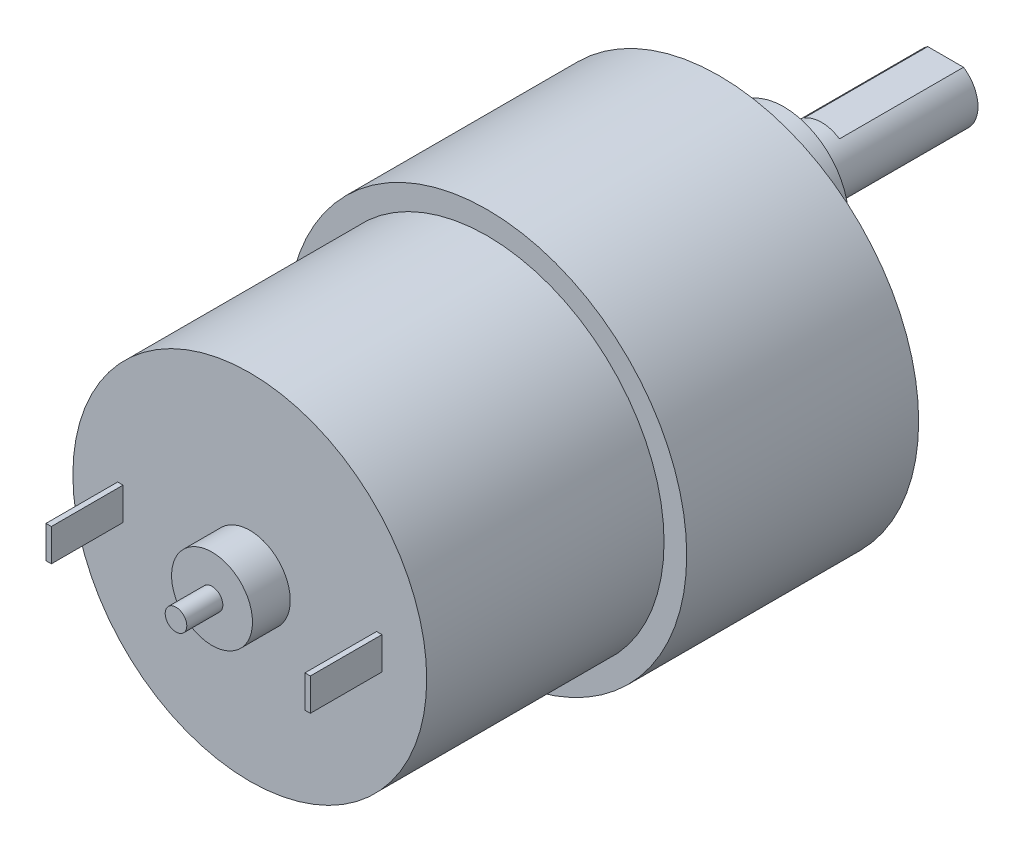
ISO-10303-21;
HEADER;
FILE_DESCRIPTION(('STEP AP214'),'2;1');
FILE_NAME('part.step','',(''),(''),'','','');
FILE_SCHEMA(('AUTOMOTIVE_DESIGN { 1 0 10303 214 1 1 1 1 }'));
ENDSEC;
DATA;
#1=APPLICATION_CONTEXT('core data for automotive mechanical design processes');
#2=APPLICATION_PROTOCOL_DEFINITION('international standard','automotive_design',2000,#1);
#3=PRODUCT_CONTEXT('',#1,'mechanical');
#4=PRODUCT('Part','Part','',(#3));
#5=PRODUCT_RELATED_PRODUCT_CATEGORY('part','',(#4));
#6=PRODUCT_DEFINITION_FORMATION('','',#4);
#7=PRODUCT_DEFINITION_CONTEXT('part definition',#1,'design');
#8=PRODUCT_DEFINITION('design','',#6,#7);
#9=PRODUCT_DEFINITION_SHAPE('','',#8);
#10=(LENGTH_UNIT() NAMED_UNIT(*) SI_UNIT(.MILLI.,.METRE.));
#11=(NAMED_UNIT(*) PLANE_ANGLE_UNIT() SI_UNIT($,.RADIAN.));
#12=(NAMED_UNIT(*) SI_UNIT($,.STERADIAN.) SOLID_ANGLE_UNIT());
#13=UNCERTAINTY_MEASURE_WITH_UNIT(LENGTH_MEASURE(1.E-05),#10,'distance_accuracy_value','');
#14=(GEOMETRIC_REPRESENTATION_CONTEXT(3) GLOBAL_UNCERTAINTY_ASSIGNED_CONTEXT((#13)) GLOBAL_UNIT_ASSIGNED_CONTEXT((#10,
#11,#12)) REPRESENTATION_CONTEXT('',''));
#15=CARTESIAN_POINT('',(0.,0.,0.));
#16=DIRECTION('',(0.,0.,1.));
#17=DIRECTION('',(1.,0.,0.));
#18=AXIS2_PLACEMENT_3D('',#15,#16,#17);
#19=CARTESIAN_POINT('',(0.,0.,43.5));
#20=DIRECTION('',(0.,0.,1.));
#21=DIRECTION('',(1.,0.,0.));
#22=AXIS2_PLACEMENT_3D('',#19,#20,#21);
#23=PLANE('',#22);
#24=CARTESIAN_POINT('',(0.,0.,43.5));
#25=DIRECTION('',(0.,0.,1.));
#26=DIRECTION('',(1.,0.,0.));
#27=AXIS2_PLACEMENT_3D('',#24,#25,#26);
#28=CIRCLE('',#27,3.75);
#29=CARTESIAN_POINT('',(3.75,0.,43.5));
#30=VERTEX_POINT('',#29);
#31=EDGE_CURVE('E171',#30,#30,#28,.T.);
#32=ORIENTED_EDGE('',*,*,#31,.F.);
#33=EDGE_LOOP('',(#32));
#34=FACE_BOUND('',#33,.T.);
#35=CARTESIAN_POINT('',(0.,0.,43.5));
#36=DIRECTION('',(0.,0.,1.));
#37=DIRECTION('',(1.,0.,0.));
#38=AXIS2_PLACEMENT_3D('',#35,#36,#37);
#39=CIRCLE('',#38,16.4);
#40=CARTESIAN_POINT('',(16.4,0.,43.5));
#41=VERTEX_POINT('',#40);
#42=EDGE_CURVE('E180',#41,#41,#39,.T.);
#43=ORIENTED_EDGE('',*,*,#42,.T.);
#44=EDGE_LOOP('',(#43));
#45=FACE_BOUND('',#44,.T.);
#46=DIRECTION('',(-1.,0.,0.));
#47=VECTOR('',#46,1.);
#48=CARTESIAN_POINT('',(-12.25,1.5,43.5));
#49=LINE('',#48,#47);
#50=CARTESIAN_POINT('',(-11.75,1.5,43.5));
#51=VERTEX_POINT('',#50);
#52=CARTESIAN_POINT('',(-12.25,1.5,43.5));
#53=VERTEX_POINT('',#52);
#54=EDGE_CURVE('E143',#51,#53,#49,.T.);
#55=ORIENTED_EDGE('',*,*,#54,.F.);
#56=DIRECTION('',(0.,1.,0.));
#57=VECTOR('',#56,1.);
#58=CARTESIAN_POINT('',(-11.75,1.5,43.5));
#59=LINE('',#58,#57);
#60=CARTESIAN_POINT('',(-11.75,-1.5,43.5));
#61=VERTEX_POINT('',#60);
#62=EDGE_CURVE('E140',#61,#51,#59,.T.);
#63=ORIENTED_EDGE('',*,*,#62,.F.);
#64=DIRECTION('',(1.,0.,0.));
#65=VECTOR('',#64,1.);
#66=CARTESIAN_POINT('',(-12.25,-1.5,43.5));
#67=LINE('',#66,#65);
#68=CARTESIAN_POINT('',(-12.25,-1.5,43.5));
#69=VERTEX_POINT('',#68);
#70=EDGE_CURVE('E152',#69,#61,#67,.T.);
#71=ORIENTED_EDGE('',*,*,#70,.F.);
#72=DIRECTION('',(0.,-1.,0.));
#73=VECTOR('',#72,1.);
#74=CARTESIAN_POINT('',(-12.25,1.5,43.5));
#75=LINE('',#74,#73);
#76=EDGE_CURVE('E160',#53,#69,#75,.T.);
#77=ORIENTED_EDGE('',*,*,#76,.F.);
#78=EDGE_LOOP('',(#55,#63,#71,#77));
#79=FACE_BOUND('',#78,.T.);
#80=DIRECTION('',(-1.,0.,0.));
#81=VECTOR('',#80,1.);
#82=CARTESIAN_POINT('',(12.25,1.5,43.5));
#83=LINE('',#82,#81);
#84=CARTESIAN_POINT('',(12.25,1.5,43.5));
#85=VERTEX_POINT('',#84);
#86=CARTESIAN_POINT('',(11.75,1.5,43.5));
#87=VERTEX_POINT('',#86);
#88=EDGE_CURVE('E625',#85,#87,#83,.T.);
#89=ORIENTED_EDGE('',*,*,#88,.F.);
#90=DIRECTION('',(0.,1.,0.));
#91=VECTOR('',#90,1.);
#92=CARTESIAN_POINT('',(12.25,1.5,43.5));
#93=LINE('',#92,#91);
#94=CARTESIAN_POINT('',(12.25,-1.5,43.5));
#95=VERTEX_POINT('',#94);
#96=EDGE_CURVE('E138',#95,#85,#93,.T.);
#97=ORIENTED_EDGE('',*,*,#96,.F.);
#98=DIRECTION('',(1.,0.,0.));
#99=VECTOR('',#98,1.);
#100=CARTESIAN_POINT('',(12.25,-1.5,43.5));
#101=LINE('',#100,#99);
#102=CARTESIAN_POINT('',(11.75,-1.5,43.5));
#103=VERTEX_POINT('',#102);
#104=EDGE_CURVE('E134',#103,#95,#101,.T.);
#105=ORIENTED_EDGE('',*,*,#104,.F.);
#106=DIRECTION('',(0.,-1.,0.));
#107=VECTOR('',#106,1.);
#108=CARTESIAN_POINT('',(11.75,1.5,43.5));
#109=LINE('',#108,#107);
#110=EDGE_CURVE('E622',#87,#103,#109,.T.);
#111=ORIENTED_EDGE('',*,*,#110,.F.);
#112=EDGE_LOOP('',(#89,#97,#105,#111));
#113=FACE_BOUND('',#112,.T.);
#114=ADVANCED_FACE('F35',(#34,#45,#79,#113),#23,.T.);
#115=CARTESIAN_POINT('',(0.,0.,21.5));
#116=DIRECTION('',(0.,0.,-1.));
#117=DIRECTION('',(-1.,0.,0.));
#118=AXIS2_PLACEMENT_3D('',#115,#116,#117);
#119=CYLINDRICAL_SURFACE('',#118,18.5);
#120=CARTESIAN_POINT('',(0.,0.,21.5));
#121=DIRECTION('',(0.,0.,1.));
#122=DIRECTION('',(1.,0.,0.));
#123=AXIS2_PLACEMENT_3D('',#120,#121,#122);
#124=CIRCLE('',#123,18.5);
#125=CARTESIAN_POINT('',(18.5,0.,21.5));
#126=VERTEX_POINT('',#125);
#127=EDGE_CURVE('E243',#126,#126,#124,.T.);
#128=ORIENTED_EDGE('',*,*,#127,.F.);
#129=EDGE_LOOP('',(#128));
#130=FACE_BOUND('',#129,.T.);
#131=CARTESIAN_POINT('',(0.,0.,0.));
#132=DIRECTION('',(0.,0.,1.));
#133=DIRECTION('',(1.,0.,0.));
#134=AXIS2_PLACEMENT_3D('',#131,#132,#133);
#135=CIRCLE('',#134,18.5);
#136=CARTESIAN_POINT('',(18.5,0.,0.));
#137=VERTEX_POINT('',#136);
#138=EDGE_CURVE('E242',#137,#137,#135,.T.);
#139=ORIENTED_EDGE('',*,*,#138,.T.);
#140=EDGE_LOOP('',(#139));
#141=FACE_BOUND('',#140,.T.);
#142=ADVANCED_FACE('F37',(#130,#141),#119,.T.);
#143=CARTESIAN_POINT('',(0.,0.,21.5));
#144=DIRECTION('',(0.,0.,1.));
#145=DIRECTION('',(1.,0.,0.));
#146=AXIS2_PLACEMENT_3D('',#143,#144,#145);
#147=PLANE('',#146);
#148=CARTESIAN_POINT('',(0.,0.,21.5));
#149=DIRECTION('',(0.,0.,1.));
#150=DIRECTION('',(1.,0.,0.));
#151=AXIS2_PLACEMENT_3D('',#148,#149,#150);
#152=CIRCLE('',#151,16.4);
#153=CARTESIAN_POINT('',(16.4,0.,21.5));
#154=VERTEX_POINT('',#153);
#155=EDGE_CURVE('E11',#154,#154,#152,.T.);
#156=ORIENTED_EDGE('',*,*,#155,.F.);
#157=EDGE_LOOP('',(#156));
#158=FACE_BOUND('',#157,.T.);
#159=ORIENTED_EDGE('',*,*,#127,.T.);
#160=EDGE_LOOP('',(#159));
#161=FACE_BOUND('',#160,.T.);
#162=ADVANCED_FACE('F255',(#158,#161),#147,.T.);
#163=CARTESIAN_POINT('',(0.,0.,0.));
#164=DIRECTION('',(0.,0.,1.));
#165=DIRECTION('',(1.,0.,0.));
#166=AXIS2_PLACEMENT_3D('',#163,#164,#165);
#167=PLANE('',#166);
#168=CARTESIAN_POINT('',(-15.5,0.,0.));
#169=DIRECTION('',(0.,0.,-1.));
#170=DIRECTION('',(-1.,0.,0.));
#171=AXIS2_PLACEMENT_3D('',#168,#169,#170);
#172=CIRCLE('',#171,1.5);
#173=CARTESIAN_POINT('',(-17.,0.,0.));
#174=VERTEX_POINT('',#173);
#175=EDGE_CURVE('E188',#174,#174,#172,.T.);
#176=ORIENTED_EDGE('',*,*,#175,.F.);
#177=EDGE_LOOP('',(#176));
#178=FACE_BOUND('',#177,.T.);
#179=CARTESIAN_POINT('',(-7.75000000000016,13.4233937586587,0.));
#180=DIRECTION('',(0.,0.,-1.));
#181=DIRECTION('',(-1.,0.,0.));
#182=AXIS2_PLACEMENT_3D('',#179,#180,#181);
#183=CIRCLE('',#182,1.5);
#184=CARTESIAN_POINT('',(-9.25000000000016,13.4233937586587,0.));
#185=VERTEX_POINT('',#184);
#186=EDGE_CURVE('E182',#185,#185,#183,.T.);
#187=ORIENTED_EDGE('',*,*,#186,.F.);
#188=EDGE_LOOP('',(#187));
#189=FACE_BOUND('',#188,.T.);
#190=CARTESIAN_POINT('',(7.74999999999987,13.4233937586589,0.));
#191=DIRECTION('',(0.,0.,-1.));
#192=DIRECTION('',(-1.,0.,0.));
#193=AXIS2_PLACEMENT_3D('',#190,#191,#192);
#194=CIRCLE('',#193,1.5);
#195=CARTESIAN_POINT('',(6.24999999999987,13.4233937586589,0.));
#196=VERTEX_POINT('',#195);
#197=EDGE_CURVE('E195',#196,#196,#194,.T.);
#198=ORIENTED_EDGE('',*,*,#197,.F.);
#199=EDGE_LOOP('',(#198));
#200=FACE_BOUND('',#199,.T.);
#201=CARTESIAN_POINT('',(15.5,1.08235921504137E-13,0.));
#202=DIRECTION('',(0.,0.,-1.));
#203=DIRECTION('',(-1.,0.,0.));
#204=AXIS2_PLACEMENT_3D('',#201,#202,#203);
#205=CIRCLE('',#204,1.5);
#206=CARTESIAN_POINT('',(14.,1.08235921504137E-13,0.));
#207=VERTEX_POINT('',#206);
#208=EDGE_CURVE('E212',#207,#207,#205,.T.);
#209=ORIENTED_EDGE('',*,*,#208,.F.);
#210=EDGE_LOOP('',(#209));
#211=FACE_BOUND('',#210,.T.);
#212=CARTESIAN_POINT('',(7.75000000000006,-13.4233937586588,0.));
#213=DIRECTION('',(0.,0.,-1.));
#214=DIRECTION('',(-1.,0.,0.));
#215=AXIS2_PLACEMENT_3D('',#212,#213,#214);
#216=CIRCLE('',#215,1.5);
#217=CARTESIAN_POINT('',(6.25000000000006,-13.4233937586588,0.));
#218=VERTEX_POINT('',#217);
#219=EDGE_CURVE('E206',#218,#218,#216,.T.);
#220=ORIENTED_EDGE('',*,*,#219,.F.);
#221=EDGE_LOOP('',(#220));
#222=FACE_BOUND('',#221,.T.);
#223=CARTESIAN_POINT('',(-7.74999999999997,-13.4233937586588,0.));
#224=DIRECTION('',(0.,0.,-1.));
#225=DIRECTION('',(-1.,0.,0.));
#226=AXIS2_PLACEMENT_3D('',#223,#224,#225);
#227=CIRCLE('',#226,1.5);
#228=CARTESIAN_POINT('',(-9.24999999999997,-13.4233937586588,0.));
#229=VERTEX_POINT('',#228);
#230=EDGE_CURVE('E200',#229,#229,#227,.T.);
#231=ORIENTED_EDGE('',*,*,#230,.F.);
#232=EDGE_LOOP('',(#231));
#233=FACE_BOUND('',#232,.T.);
#234=CARTESIAN_POINT('',(0.,7.,0.));
#235=DIRECTION('',(0.,0.,1.));
#236=DIRECTION('',(1.,0.,0.));
#237=AXIS2_PLACEMENT_3D('',#234,#235,#236);
#238=CIRCLE('',#237,6.);
#239=CARTESIAN_POINT('',(6.,7.,0.));
#240=VERTEX_POINT('',#239);
#241=EDGE_CURVE('E239',#240,#240,#238,.F.);
#242=ORIENTED_EDGE('',*,*,#241,.F.);
#243=EDGE_LOOP('',(#242));
#244=FACE_BOUND('',#243,.T.);
#245=ORIENTED_EDGE('',*,*,#138,.F.);
#246=EDGE_LOOP('',(#245));
#247=FACE_BOUND('',#246,.T.);
#248=ADVANCED_FACE('F252',(#178,#189,#200,#211,#222,#233,#244,#247),#167,.F.);
#249=CARTESIAN_POINT('',(0.,7.,-6.));
#250=DIRECTION('',(0.,0.,1.));
#251=DIRECTION('',(1.,0.,0.));
#252=AXIS2_PLACEMENT_3D('',#249,#250,#251);
#253=CYLINDRICAL_SURFACE('',#252,6.);
#254=CARTESIAN_POINT('',(0.,7.,-6.));
#255=DIRECTION('',(0.,0.,-1.));
#256=DIRECTION('',(-1.,0.,0.));
#257=AXIS2_PLACEMENT_3D('',#254,#255,#256);
#258=CIRCLE('',#257,6.);
#259=CARTESIAN_POINT('',(-6.,7.,-6.));
#260=VERTEX_POINT('',#259);
#261=EDGE_CURVE('E236',#260,#260,#258,.T.);
#262=ORIENTED_EDGE('',*,*,#261,.F.);
#263=EDGE_LOOP('',(#262));
#264=FACE_BOUND('',#263,.T.);
#265=ORIENTED_EDGE('',*,*,#241,.T.);
#266=EDGE_LOOP('',(#265));
#267=FACE_BOUND('',#266,.T.);
#268=ADVANCED_FACE('F250',(#264,#267),#253,.T.);
#269=CARTESIAN_POINT('',(0.,7.,-6.));
#270=DIRECTION('',(0.,0.,-1.));
#271=DIRECTION('',(-1.,0.,0.));
#272=AXIS2_PLACEMENT_3D('',#269,#270,#271);
#273=PLANE('',#272);
#274=CARTESIAN_POINT('',(0.,7.,-6.));
#275=DIRECTION('',(0.,0.,-1.));
#276=DIRECTION('',(-1.,0.,0.));
#277=AXIS2_PLACEMENT_3D('',#274,#275,#276);
#278=CIRCLE('',#277,3.);
#279=CARTESIAN_POINT('',(-3.,7.,-6.));
#280=VERTEX_POINT('',#279);
#281=EDGE_CURVE('E44',#280,#280,#278,.T.);
#282=ORIENTED_EDGE('',*,*,#281,.F.);
#283=EDGE_LOOP('',(#282));
#284=FACE_BOUND('',#283,.T.);
#285=ORIENTED_EDGE('',*,*,#261,.T.);
#286=EDGE_LOOP('',(#285));
#287=FACE_BOUND('',#286,.T.);
#288=ADVANCED_FACE('F347',(#284,#287),#273,.T.);
#289=CARTESIAN_POINT('',(0.,7.,-21.));
#290=DIRECTION('',(0.,0.,1.));
#291=DIRECTION('',(1.,0.,0.));
#292=AXIS2_PLACEMENT_3D('',#289,#290,#291);
#293=CYLINDRICAL_SURFACE('',#292,3.);
#294=CARTESIAN_POINT('',(0.,7.,-21.));
#295=DIRECTION('',(0.,0.,-1.));
#296=DIRECTION('',(-1.,0.,0.));
#297=AXIS2_PLACEMENT_3D('',#294,#295,#296);
#298=CIRCLE('',#297,3.);
#299=CARTESIAN_POINT('',(1.6583123951777,9.5,-21.));
#300=VERTEX_POINT('',#299);
#301=CARTESIAN_POINT('',(-1.6583123951777,9.5,-21.));
#302=VERTEX_POINT('',#301);
#303=EDGE_CURVE('E231',#300,#302,#298,.T.);
#304=ORIENTED_EDGE('',*,*,#303,.F.);
#305=DIRECTION('',(0.,0.,1.));
#306=VECTOR('',#305,1.);
#307=CARTESIAN_POINT('',(1.6583123951777,9.5,-158.388815632809));
#308=LINE('',#307,#306);
#309=CARTESIAN_POINT('',(1.6583123951777,9.5,-9.5));
#310=VERTEX_POINT('',#309);
#311=EDGE_CURVE('E226',#300,#310,#308,.T.);
#312=ORIENTED_EDGE('',*,*,#311,.T.);
#313=CARTESIAN_POINT('',(0.,7.,-9.5));
#314=DIRECTION('',(0.,0.,-1.));
#315=DIRECTION('',(-1.,0.,0.));
#316=AXIS2_PLACEMENT_3D('',#313,#314,#315);
#317=CIRCLE('',#316,3.);
#318=CARTESIAN_POINT('',(-1.6583123951777,9.5,-9.5));
#319=VERTEX_POINT('',#318);
#320=EDGE_CURVE('E187',#319,#310,#317,.T.);
#321=ORIENTED_EDGE('',*,*,#320,.F.);
#322=DIRECTION('',(0.,0.,1.));
#323=VECTOR('',#322,1.);
#324=CARTESIAN_POINT('',(-1.6583123951777,9.5,-158.388815632809));
#325=LINE('',#324,#323);
#326=EDGE_CURVE('E223',#302,#319,#325,.T.);
#327=ORIENTED_EDGE('',*,*,#326,.F.);
#328=EDGE_LOOP('',(#304,#312,#321,#327));
#329=FACE_BOUND('',#328,.T.);
#330=ORIENTED_EDGE('',*,*,#281,.T.);
#331=EDGE_LOOP('',(#330));
#332=FACE_BOUND('',#331,.T.);
#333=ADVANCED_FACE('F343',(#329,#332),#293,.T.);
#334=CARTESIAN_POINT('',(0.,7.,-21.));
#335=DIRECTION('',(0.,0.,-1.));
#336=DIRECTION('',(-1.,0.,0.));
#337=AXIS2_PLACEMENT_3D('',#334,#335,#336);
#338=PLANE('',#337);
#339=DIRECTION('',(-1.,0.,0.));
#340=VECTOR('',#339,1.);
#341=CARTESIAN_POINT('',(1.6583123951777,9.5,-21.));
#342=LINE('',#341,#340);
#343=EDGE_CURVE('E228',#300,#302,#342,.T.);
#344=ORIENTED_EDGE('',*,*,#343,.F.);
#345=ORIENTED_EDGE('',*,*,#303,.T.);
#346=EDGE_LOOP('',(#344,#345));
#347=FACE_BOUND('',#346,.T.);
#348=ADVANCED_FACE('F336',(#347),#338,.T.);
#349=CARTESIAN_POINT('',(1.6583123951777,9.5,-158.388815632809));
#350=DIRECTION('',(0.,1.,0.));
#351=DIRECTION('',(0.,0.,1.));
#352=AXIS2_PLACEMENT_3D('',#349,#350,#351);
#353=PLANE('',#352);
#354=ORIENTED_EDGE('',*,*,#311,.F.);
#355=ORIENTED_EDGE('',*,*,#343,.T.);
#356=ORIENTED_EDGE('',*,*,#326,.T.);
#357=DIRECTION('',(-1.,0.,0.));
#358=VECTOR('',#357,1.);
#359=CARTESIAN_POINT('',(1.6583123951777,9.5,-9.50000000000001));
#360=LINE('',#359,#358);
#361=EDGE_CURVE('E220',#310,#319,#360,.T.);
#362=ORIENTED_EDGE('',*,*,#361,.F.);
#363=EDGE_LOOP('',(#354,#355,#356,#362));
#364=FACE_BOUND('',#363,.T.);
#365=ADVANCED_FACE('F333',(#364),#353,.T.);
#366=CARTESIAN_POINT('',(0.,7.,-9.5));
#367=DIRECTION('',(0.,0.,-1.));
#368=DIRECTION('',(-1.,0.,0.));
#369=AXIS2_PLACEMENT_3D('',#366,#367,#368);
#370=PLANE('',#369);
#371=ORIENTED_EDGE('',*,*,#361,.T.);
#372=ORIENTED_EDGE('',*,*,#320,.T.);
#373=EDGE_LOOP('',(#371,#372));
#374=FACE_BOUND('',#373,.T.);
#375=ADVANCED_FACE('F309',(#374),#370,.T.);
#376=CARTESIAN_POINT('',(-7.74999999999997,-13.4233937586588,5.));
#377=DIRECTION('',(0.,0.,-1.));
#378=DIRECTION('',(-1.,0.,0.));
#379=AXIS2_PLACEMENT_3D('',#376,#377,#378);
#380=CYLINDRICAL_SURFACE('',#379,1.5);
#381=CARTESIAN_POINT('',(-7.74999999999997,-13.4233937586588,5.));
#382=DIRECTION('',(0.,0.,-1.));
#383=DIRECTION('',(-1.,0.,0.));
#384=AXIS2_PLACEMENT_3D('',#381,#382,#383);
#385=CIRCLE('',#384,1.5);
#386=CARTESIAN_POINT('',(-9.24999999999997,-13.4233937586588,5.));
#387=VERTEX_POINT('',#386);
#388=EDGE_CURVE('E191',#387,#387,#385,.T.);
#389=ORIENTED_EDGE('',*,*,#388,.F.);
#390=EDGE_LOOP('',(#389));
#391=FACE_BOUND('',#390,.T.);
#392=ORIENTED_EDGE('',*,*,#230,.T.);
#393=EDGE_LOOP('',(#392));
#394=FACE_BOUND('',#393,.T.);
#395=ADVANCED_FACE('F305',(#391,#394),#380,.F.);
#396=CARTESIAN_POINT('',(-7.74999999999997,-13.4233937586588,5.));
#397=DIRECTION('',(0.,0.,-1.));
#398=DIRECTION('',(-1.,0.,0.));
#399=AXIS2_PLACEMENT_3D('',#396,#397,#398);
#400=PLANE('',#399);
#401=ORIENTED_EDGE('',*,*,#388,.T.);
#402=EDGE_LOOP('',(#401));
#403=FACE_BOUND('',#402,.T.);
#404=ADVANCED_FACE('F301',(#403),#400,.T.);
#405=CARTESIAN_POINT('',(7.75000000000006,-13.4233937586588,5.));
#406=DIRECTION('',(0.,0.,-1.));
#407=DIRECTION('',(-1.,0.,0.));
#408=AXIS2_PLACEMENT_3D('',#405,#406,#407);
#409=CYLINDRICAL_SURFACE('',#408,1.5);
#410=CARTESIAN_POINT('',(7.75000000000006,-13.4233937586588,5.));
#411=DIRECTION('',(0.,0.,-1.));
#412=DIRECTION('',(-1.,0.,0.));
#413=AXIS2_PLACEMENT_3D('',#410,#411,#412);
#414=CIRCLE('',#413,1.5);
#415=CARTESIAN_POINT('',(6.25000000000006,-13.4233937586588,5.));
#416=VERTEX_POINT('',#415);
#417=EDGE_CURVE('E203',#416,#416,#414,.T.);
#418=ORIENTED_EDGE('',*,*,#417,.F.);
#419=EDGE_LOOP('',(#418));
#420=FACE_BOUND('',#419,.T.);
#421=ORIENTED_EDGE('',*,*,#219,.T.);
#422=EDGE_LOOP('',(#421));
#423=FACE_BOUND('',#422,.T.);
#424=ADVANCED_FACE('F304',(#420,#423),#409,.F.);
#425=CARTESIAN_POINT('',(7.75000000000006,-13.4233937586588,5.));
#426=DIRECTION('',(0.,0.,-1.));
#427=DIRECTION('',(-1.,0.,0.));
#428=AXIS2_PLACEMENT_3D('',#425,#426,#427);
#429=PLANE('',#428);
#430=ORIENTED_EDGE('',*,*,#417,.T.);
#431=EDGE_LOOP('',(#430));
#432=FACE_BOUND('',#431,.T.);
#433=ADVANCED_FACE('F311',(#432),#429,.T.);
#434=CARTESIAN_POINT('',(15.5,1.08235921504137E-13,5.));
#435=DIRECTION('',(0.,0.,-1.));
#436=DIRECTION('',(-1.,0.,0.));
#437=AXIS2_PLACEMENT_3D('',#434,#435,#436);
#438=CYLINDRICAL_SURFACE('',#437,1.5);
#439=CARTESIAN_POINT('',(15.5,1.08235921504137E-13,5.));
#440=DIRECTION('',(0.,0.,-1.));
#441=DIRECTION('',(-1.,0.,0.));
#442=AXIS2_PLACEMENT_3D('',#439,#440,#441);
#443=CIRCLE('',#442,1.5);
#444=CARTESIAN_POINT('',(14.,1.08235921504137E-13,5.));
#445=VERTEX_POINT('',#444);
#446=EDGE_CURVE('E209',#445,#445,#443,.T.);
#447=ORIENTED_EDGE('',*,*,#446,.F.);
#448=EDGE_LOOP('',(#447));
#449=FACE_BOUND('',#448,.T.);
#450=ORIENTED_EDGE('',*,*,#208,.T.);
#451=EDGE_LOOP('',(#450));
#452=FACE_BOUND('',#451,.T.);
#453=ADVANCED_FACE('F314',(#449,#452),#438,.F.);
#454=CARTESIAN_POINT('',(15.5,1.08235921504137E-13,5.));
#455=DIRECTION('',(0.,0.,-1.));
#456=DIRECTION('',(-1.,0.,0.));
#457=AXIS2_PLACEMENT_3D('',#454,#455,#456);
#458=PLANE('',#457);
#459=ORIENTED_EDGE('',*,*,#446,.T.);
#460=EDGE_LOOP('',(#459));
#461=FACE_BOUND('',#460,.T.);
#462=ADVANCED_FACE('F319',(#461),#458,.T.);
#463=CARTESIAN_POINT('',(7.74999999999987,13.4233937586589,5.));
#464=DIRECTION('',(0.,0.,-1.));
#465=DIRECTION('',(-1.,0.,0.));
#466=AXIS2_PLACEMENT_3D('',#463,#464,#465);
#467=CYLINDRICAL_SURFACE('',#466,1.5);
#468=CARTESIAN_POINT('',(7.74999999999987,13.4233937586589,5.));
#469=DIRECTION('',(0.,0.,-1.));
#470=DIRECTION('',(-1.,0.,0.));
#471=AXIS2_PLACEMENT_3D('',#468,#469,#470);
#472=CIRCLE('',#471,1.5);
#473=CARTESIAN_POINT('',(6.24999999999987,13.4233937586589,5.));
#474=VERTEX_POINT('',#473);
#475=EDGE_CURVE('E215',#474,#474,#472,.T.);
#476=ORIENTED_EDGE('',*,*,#475,.F.);
#477=EDGE_LOOP('',(#476));
#478=FACE_BOUND('',#477,.T.);
#479=ORIENTED_EDGE('',*,*,#197,.T.);
#480=EDGE_LOOP('',(#479));
#481=FACE_BOUND('',#480,.T.);
#482=ADVANCED_FACE('F322',(#478,#481),#467,.F.);
#483=CARTESIAN_POINT('',(7.74999999999987,13.4233937586589,5.));
#484=DIRECTION('',(0.,0.,-1.));
#485=DIRECTION('',(-1.,0.,0.));
#486=AXIS2_PLACEMENT_3D('',#483,#484,#485);
#487=PLANE('',#486);
#488=ORIENTED_EDGE('',*,*,#475,.T.);
#489=EDGE_LOOP('',(#488));
#490=FACE_BOUND('',#489,.T.);
#491=ADVANCED_FACE('F299',(#490),#487,.T.);
#492=CARTESIAN_POINT('',(-7.75000000000016,13.4233937586587,5.));
#493=DIRECTION('',(0.,0.,-1.));
#494=DIRECTION('',(-1.,0.,0.));
#495=AXIS2_PLACEMENT_3D('',#492,#493,#494);
#496=CYLINDRICAL_SURFACE('',#495,1.5);
#497=CARTESIAN_POINT('',(-7.75000000000016,13.4233937586587,5.));
#498=DIRECTION('',(0.,0.,-1.));
#499=DIRECTION('',(-1.,0.,0.));
#500=AXIS2_PLACEMENT_3D('',#497,#498,#499);
#501=CIRCLE('',#500,1.5);
#502=CARTESIAN_POINT('',(-9.25000000000016,13.4233937586587,5.));
#503=VERTEX_POINT('',#502);
#504=EDGE_CURVE('E192',#503,#503,#501,.T.);
#505=ORIENTED_EDGE('',*,*,#504,.F.);
#506=EDGE_LOOP('',(#505));
#507=FACE_BOUND('',#506,.T.);
#508=ORIENTED_EDGE('',*,*,#186,.T.);
#509=EDGE_LOOP('',(#508));
#510=FACE_BOUND('',#509,.T.);
#511=ADVANCED_FACE('F295',(#507,#510),#496,.F.);
#512=CARTESIAN_POINT('',(-7.75000000000016,13.4233937586587,5.));
#513=DIRECTION('',(0.,0.,-1.));
#514=DIRECTION('',(-1.,0.,0.));
#515=AXIS2_PLACEMENT_3D('',#512,#513,#514);
#516=PLANE('',#515);
#517=ORIENTED_EDGE('',*,*,#504,.T.);
#518=EDGE_LOOP('',(#517));
#519=FACE_BOUND('',#518,.T.);
#520=ADVANCED_FACE('F291',(#519),#516,.T.);
#521=CARTESIAN_POINT('',(-15.5,0.,5.));
#522=DIRECTION('',(0.,0.,-1.));
#523=DIRECTION('',(-1.,0.,0.));
#524=AXIS2_PLACEMENT_3D('',#521,#522,#523);
#525=CYLINDRICAL_SURFACE('',#524,1.5);
#526=CARTESIAN_POINT('',(-15.5,0.,5.));
#527=DIRECTION('',(0.,0.,-1.));
#528=DIRECTION('',(-1.,0.,0.));
#529=AXIS2_PLACEMENT_3D('',#526,#527,#528);
#530=CIRCLE('',#529,1.5);
#531=CARTESIAN_POINT('',(-17.,0.,5.));
#532=VERTEX_POINT('',#531);
#533=EDGE_CURVE('E184',#532,#532,#530,.T.);
#534=ORIENTED_EDGE('',*,*,#533,.F.);
#535=EDGE_LOOP('',(#534));
#536=FACE_BOUND('',#535,.T.);
#537=ORIENTED_EDGE('',*,*,#175,.T.);
#538=EDGE_LOOP('',(#537));
#539=FACE_BOUND('',#538,.T.);
#540=ADVANCED_FACE('F287',(#536,#539),#525,.F.);
#541=CARTESIAN_POINT('',(-15.5,0.,5.));
#542=DIRECTION('',(0.,0.,-1.));
#543=DIRECTION('',(-1.,0.,0.));
#544=AXIS2_PLACEMENT_3D('',#541,#542,#543);
#545=PLANE('',#544);
#546=ORIENTED_EDGE('',*,*,#533,.T.);
#547=EDGE_LOOP('',(#546));
#548=FACE_BOUND('',#547,.T.);
#549=ADVANCED_FACE('F283',(#548),#545,.T.);
#550=CARTESIAN_POINT('',(0.,0.,43.5));
#551=DIRECTION('',(0.,0.,-1.));
#552=DIRECTION('',(-1.,0.,0.));
#553=AXIS2_PLACEMENT_3D('',#550,#551,#552);
#554=CYLINDRICAL_SURFACE('',#553,16.4);
#555=ORIENTED_EDGE('',*,*,#42,.F.);
#556=EDGE_LOOP('',(#555));
#557=FACE_BOUND('',#556,.T.);
#558=ORIENTED_EDGE('',*,*,#155,.T.);
#559=EDGE_LOOP('',(#558));
#560=FACE_BOUND('',#559,.T.);
#561=ADVANCED_FACE('F279',(#557,#560),#554,.T.);
#562=CARTESIAN_POINT('',(0.,0.,47.));
#563=DIRECTION('',(0.,0.,-1.));
#564=DIRECTION('',(-1.,0.,0.));
#565=AXIS2_PLACEMENT_3D('',#562,#563,#564);
#566=CYLINDRICAL_SURFACE('',#565,3.75);
#567=CARTESIAN_POINT('',(0.,0.,47.));
#568=DIRECTION('',(0.,0.,1.));
#569=DIRECTION('',(1.,0.,0.));
#570=AXIS2_PLACEMENT_3D('',#567,#568,#569);
#571=CIRCLE('',#570,3.75);
#572=CARTESIAN_POINT('',(3.75,0.,47.));
#573=VERTEX_POINT('',#572);
#574=EDGE_CURVE('E172',#573,#573,#571,.T.);
#575=ORIENTED_EDGE('',*,*,#574,.F.);
#576=EDGE_LOOP('',(#575));
#577=FACE_BOUND('',#576,.T.);
#578=ORIENTED_EDGE('',*,*,#31,.T.);
#579=EDGE_LOOP('',(#578));
#580=FACE_BOUND('',#579,.T.);
#581=ADVANCED_FACE('F282',(#577,#580),#566,.T.);
#582=CARTESIAN_POINT('',(0.,0.,47.));
#583=DIRECTION('',(0.,0.,1.));
#584=DIRECTION('',(1.,0.,0.));
#585=AXIS2_PLACEMENT_3D('',#582,#583,#584);
#586=PLANE('',#585);
#587=CARTESIAN_POINT('',(0.,0.,47.));
#588=DIRECTION('',(0.,0.,1.));
#589=DIRECTION('',(1.,0.,0.));
#590=AXIS2_PLACEMENT_3D('',#587,#588,#589);
#591=CIRCLE('',#590,1.);
#592=CARTESIAN_POINT('',(1.,0.,47.));
#593=VERTEX_POINT('',#592);
#594=EDGE_CURVE('E39',#593,#593,#591,.T.);
#595=ORIENTED_EDGE('',*,*,#594,.F.);
#596=EDGE_LOOP('',(#595));
#597=FACE_BOUND('',#596,.T.);
#598=ORIENTED_EDGE('',*,*,#574,.T.);
#599=EDGE_LOOP('',(#598));
#600=FACE_BOUND('',#599,.T.);
#601=ADVANCED_FACE('F440',(#597,#600),#586,.T.);
#602=CARTESIAN_POINT('',(0.,0.,50.34));
#603=DIRECTION('',(0.,0.,1.));
#604=DIRECTION('',(1.,0.,0.));
#605=AXIS2_PLACEMENT_3D('',#602,#603,#604);
#606=PLANE('',#605);
#607=CARTESIAN_POINT('',(0.,0.,50.34));
#608=DIRECTION('',(0.,0.,1.));
#609=DIRECTION('',(1.,0.,0.));
#610=AXIS2_PLACEMENT_3D('',#607,#608,#609);
#611=CIRCLE('',#610,1.);
#612=CARTESIAN_POINT('',(1.,0.,50.34));
#613=VERTEX_POINT('',#612);
#614=EDGE_CURVE('E177',#613,#613,#611,.T.);
#615=ORIENTED_EDGE('',*,*,#614,.T.);
#616=EDGE_LOOP('',(#615));
#617=FACE_BOUND('',#616,.T.);
#618=ADVANCED_FACE('F448',(#617),#606,.T.);
#619=CARTESIAN_POINT('',(0.,0.,50.34));
#620=DIRECTION('',(0.,0.,-1.));
#621=DIRECTION('',(-1.,0.,0.));
#622=AXIS2_PLACEMENT_3D('',#619,#620,#621);
#623=CYLINDRICAL_SURFACE('',#622,1.);
#624=ORIENTED_EDGE('',*,*,#594,.T.);
#625=EDGE_LOOP('',(#624));
#626=FACE_BOUND('',#625,.T.);
#627=ORIENTED_EDGE('',*,*,#614,.F.);
#628=EDGE_LOOP('',(#627));
#629=FACE_BOUND('',#628,.T.);
#630=ADVANCED_FACE('F277',(#626,#629),#623,.T.);
#631=CARTESIAN_POINT('',(-11.75,1.5,50.14));
#632=DIRECTION('',(-1.,0.,0.));
#633=DIRECTION('',(0.,-1.,0.));
#634=AXIS2_PLACEMENT_3D('',#631,#632,#633);
#635=PLANE('',#634);
#636=ORIENTED_EDGE('',*,*,#62,.T.);
#637=DIRECTION('',(0.,0.,-1.));
#638=VECTOR('',#637,1.);
#639=CARTESIAN_POINT('',(-11.75,1.5,50.14));
#640=LINE('',#639,#638);
#641=CARTESIAN_POINT('',(-11.75,1.5,50.14));
#642=VERTEX_POINT('',#641);
#643=EDGE_CURVE('E169',#642,#51,#640,.T.);
#644=ORIENTED_EDGE('',*,*,#643,.F.);
#645=DIRECTION('',(0.,1.,0.));
#646=VECTOR('',#645,1.);
#647=CARTESIAN_POINT('',(-11.75,1.5,50.14));
#648=LINE('',#647,#646);
#649=CARTESIAN_POINT('',(-11.75,-1.5,50.14));
#650=VERTEX_POINT('',#649);
#651=EDGE_CURVE('E148',#650,#642,#648,.T.);
#652=ORIENTED_EDGE('',*,*,#651,.F.);
#653=DIRECTION('',(0.,0.,-1.));
#654=VECTOR('',#653,1.);
#655=CARTESIAN_POINT('',(-11.75,-1.5,50.14));
#656=LINE('',#655,#654);
#657=EDGE_CURVE('E157',#650,#61,#656,.T.);
#658=ORIENTED_EDGE('',*,*,#657,.T.);
#659=EDGE_LOOP('',(#636,#644,#652,#658));
#660=FACE_BOUND('',#659,.T.);
#661=ADVANCED_FACE('F461',(#660),#635,.F.);
#662=CARTESIAN_POINT('',(-12.25,1.5,50.14));
#663=DIRECTION('',(0.,-1.,0.));
#664=DIRECTION('',(0.,0.,-1.));
#665=AXIS2_PLACEMENT_3D('',#662,#663,#664);
#666=PLANE('',#665);
#667=ORIENTED_EDGE('',*,*,#54,.T.);
#668=DIRECTION('',(0.,0.,-1.));
#669=VECTOR('',#668,1.);
#670=CARTESIAN_POINT('',(-12.25,1.5,50.14));
#671=LINE('',#670,#669);
#672=CARTESIAN_POINT('',(-12.25,1.5,50.14));
#673=VERTEX_POINT('',#672);
#674=EDGE_CURVE('E166',#673,#53,#671,.T.);
#675=ORIENTED_EDGE('',*,*,#674,.F.);
#676=DIRECTION('',(-1.,0.,0.));
#677=VECTOR('',#676,1.);
#678=CARTESIAN_POINT('',(-12.25,1.5,50.14));
#679=LINE('',#678,#677);
#680=EDGE_CURVE('E151',#642,#673,#679,.T.);
#681=ORIENTED_EDGE('',*,*,#680,.F.);
#682=ORIENTED_EDGE('',*,*,#643,.T.);
#683=EDGE_LOOP('',(#667,#675,#681,#682));
#684=FACE_BOUND('',#683,.T.);
#685=ADVANCED_FACE('F468',(#684),#666,.F.);
#686=CARTESIAN_POINT('',(-12.25,1.5,50.14));
#687=DIRECTION('',(1.,0.,0.));
#688=DIRECTION('',(0.,0.,-1.));
#689=AXIS2_PLACEMENT_3D('',#686,#687,#688);
#690=PLANE('',#689);
#691=ORIENTED_EDGE('',*,*,#76,.T.);
#692=DIRECTION('',(0.,0.,-1.));
#693=VECTOR('',#692,1.);
#694=CARTESIAN_POINT('',(-12.25,-1.5,50.14));
#695=LINE('',#694,#693);
#696=CARTESIAN_POINT('',(-12.25,-1.5,50.14));
#697=VERTEX_POINT('',#696);
#698=EDGE_CURVE('E60',#697,#69,#695,.T.);
#699=ORIENTED_EDGE('',*,*,#698,.F.);
#700=DIRECTION('',(0.,-1.,0.));
#701=VECTOR('',#700,1.);
#702=CARTESIAN_POINT('',(-12.25,1.5,50.14));
#703=LINE('',#702,#701);
#704=EDGE_CURVE('E154',#673,#697,#703,.T.);
#705=ORIENTED_EDGE('',*,*,#704,.F.);
#706=ORIENTED_EDGE('',*,*,#674,.T.);
#707=EDGE_LOOP('',(#691,#699,#705,#706));
#708=FACE_BOUND('',#707,.T.);
#709=ADVANCED_FACE('F476',(#708),#690,.F.);
#710=CARTESIAN_POINT('',(-12.25,-1.5,50.14));
#711=DIRECTION('',(0.,1.,0.));
#712=DIRECTION('',(0.,0.,1.));
#713=AXIS2_PLACEMENT_3D('',#710,#711,#712);
#714=PLANE('',#713);
#715=ORIENTED_EDGE('',*,*,#70,.T.);
#716=ORIENTED_EDGE('',*,*,#657,.F.);
#717=DIRECTION('',(1.,0.,0.));
#718=VECTOR('',#717,1.);
#719=CARTESIAN_POINT('',(-12.25,-1.5,50.14));
#720=LINE('',#719,#718);
#721=EDGE_CURVE('E156',#697,#650,#720,.T.);
#722=ORIENTED_EDGE('',*,*,#721,.F.);
#723=ORIENTED_EDGE('',*,*,#698,.T.);
#724=EDGE_LOOP('',(#715,#716,#722,#723));
#725=FACE_BOUND('',#724,.T.);
#726=ADVANCED_FACE('F484',(#725),#714,.F.);
#727=CARTESIAN_POINT('',(0.,0.,50.14));
#728=DIRECTION('',(0.,0.,1.));
#729=DIRECTION('',(1.,0.,0.));
#730=AXIS2_PLACEMENT_3D('',#727,#728,#729);
#731=PLANE('',#730);
#732=ORIENTED_EDGE('',*,*,#651,.T.);
#733=ORIENTED_EDGE('',*,*,#680,.T.);
#734=ORIENTED_EDGE('',*,*,#704,.T.);
#735=ORIENTED_EDGE('',*,*,#721,.T.);
#736=EDGE_LOOP('',(#732,#733,#734,#735));
#737=FACE_BOUND('',#736,.T.);
#738=ADVANCED_FACE('F492',(#737),#731,.T.);
#739=CARTESIAN_POINT('',(12.25,1.5,50.14));
#740=DIRECTION('',(-1.,0.,0.));
#741=DIRECTION('',(0.,0.,1.));
#742=AXIS2_PLACEMENT_3D('',#739,#740,#741);
#743=PLANE('',#742);
#744=ORIENTED_EDGE('',*,*,#96,.T.);
#745=DIRECTION('',(0.,0.,-1.));
#746=VECTOR('',#745,1.);
#747=CARTESIAN_POINT('',(12.25,1.5,50.14));
#748=LINE('',#747,#746);
#749=CARTESIAN_POINT('',(12.25,1.5,50.14));
#750=VERTEX_POINT('',#749);
#751=EDGE_CURVE('E119',#750,#85,#748,.T.);
#752=ORIENTED_EDGE('',*,*,#751,.F.);
#753=DIRECTION('',(0.,1.,0.));
#754=VECTOR('',#753,1.);
#755=CARTESIAN_POINT('',(12.25,1.5,50.14));
#756=LINE('',#755,#754);
#757=CARTESIAN_POINT('',(12.25,-1.5,50.14));
#758=VERTEX_POINT('',#757);
#759=EDGE_CURVE('E126',#758,#750,#756,.T.);
#760=ORIENTED_EDGE('',*,*,#759,.F.);
#761=DIRECTION('',(0.,0.,-1.));
#762=VECTOR('',#761,1.);
#763=CARTESIAN_POINT('',(12.25,-1.5,50.14));
#764=LINE('',#763,#762);
#765=EDGE_CURVE('E619',#758,#95,#764,.T.);
#766=ORIENTED_EDGE('',*,*,#765,.T.);
#767=EDGE_LOOP('',(#744,#752,#760,#766));
#768=FACE_BOUND('',#767,.T.);
#769=ADVANCED_FACE('F136',(#768),#743,.F.);
#770=CARTESIAN_POINT('',(12.25,1.5,50.14));
#771=DIRECTION('',(0.,-1.,0.));
#772=DIRECTION('',(0.,0.,-1.));
#773=AXIS2_PLACEMENT_3D('',#770,#771,#772);
#774=PLANE('',#773);
#775=ORIENTED_EDGE('',*,*,#88,.T.);
#776=DIRECTION('',(0.,0.,-1.));
#777=VECTOR('',#776,1.);
#778=CARTESIAN_POINT('',(11.75,1.5,50.14));
#779=LINE('',#778,#777);
#780=CARTESIAN_POINT('',(11.75,1.5,50.14));
#781=VERTEX_POINT('',#780);
#782=EDGE_CURVE('E122',#781,#87,#779,.T.);
#783=ORIENTED_EDGE('',*,*,#782,.F.);
#784=DIRECTION('',(-1.,0.,0.));
#785=VECTOR('',#784,1.);
#786=CARTESIAN_POINT('',(12.25,1.5,50.14));
#787=LINE('',#786,#785);
#788=EDGE_CURVE('E115',#750,#781,#787,.T.);
#789=ORIENTED_EDGE('',*,*,#788,.F.);
#790=ORIENTED_EDGE('',*,*,#751,.T.);
#791=EDGE_LOOP('',(#775,#783,#789,#790));
#792=FACE_BOUND('',#791,.T.);
#793=ADVANCED_FACE('F117',(#792),#774,.F.);
#794=CARTESIAN_POINT('',(11.75,1.5,50.14));
#795=DIRECTION('',(1.,0.,0.));
#796=DIRECTION('',(0.,1.,0.));
#797=AXIS2_PLACEMENT_3D('',#794,#795,#796);
#798=PLANE('',#797);
#799=ORIENTED_EDGE('',*,*,#110,.T.);
#800=DIRECTION('',(0.,0.,-1.));
#801=VECTOR('',#800,1.);
#802=CARTESIAN_POINT('',(11.75,-1.5,50.14));
#803=LINE('',#802,#801);
#804=CARTESIAN_POINT('',(11.75,-1.5,50.14));
#805=VERTEX_POINT('',#804);
#806=EDGE_CURVE('E52',#805,#103,#803,.T.);
#807=ORIENTED_EDGE('',*,*,#806,.F.);
#808=DIRECTION('',(0.,-1.,0.));
#809=VECTOR('',#808,1.);
#810=CARTESIAN_POINT('',(11.75,1.5,50.14));
#811=LINE('',#810,#809);
#812=EDGE_CURVE('E125',#781,#805,#811,.T.);
#813=ORIENTED_EDGE('',*,*,#812,.F.);
#814=ORIENTED_EDGE('',*,*,#782,.T.);
#815=EDGE_LOOP('',(#799,#807,#813,#814));
#816=FACE_BOUND('',#815,.T.);
#817=ADVANCED_FACE('F512',(#816),#798,.F.);
#818=CARTESIAN_POINT('',(12.25,-1.5,50.14));
#819=DIRECTION('',(0.,1.,0.));
#820=DIRECTION('',(0.,0.,1.));
#821=AXIS2_PLACEMENT_3D('',#818,#819,#820);
#822=PLANE('',#821);
#823=ORIENTED_EDGE('',*,*,#104,.T.);
#824=ORIENTED_EDGE('',*,*,#765,.F.);
#825=DIRECTION('',(1.,0.,0.));
#826=VECTOR('',#825,1.);
#827=CARTESIAN_POINT('',(12.25,-1.5,50.14));
#828=LINE('',#827,#826);
#829=EDGE_CURVE('E130',#805,#758,#828,.T.);
#830=ORIENTED_EDGE('',*,*,#829,.F.);
#831=ORIENTED_EDGE('',*,*,#806,.T.);
#832=EDGE_LOOP('',(#823,#824,#830,#831));
#833=FACE_BOUND('',#832,.T.);
#834=ADVANCED_FACE('F519',(#833),#822,.F.);
#835=CARTESIAN_POINT('',(0.,0.,50.14));
#836=DIRECTION('',(0.,0.,-1.));
#837=DIRECTION('',(-1.,0.,0.));
#838=AXIS2_PLACEMENT_3D('',#835,#836,#837);
#839=PLANE('',#838);
#840=ORIENTED_EDGE('',*,*,#759,.T.);
#841=ORIENTED_EDGE('',*,*,#788,.T.);
#842=ORIENTED_EDGE('',*,*,#812,.T.);
#843=ORIENTED_EDGE('',*,*,#829,.T.);
#844=EDGE_LOOP('',(#840,#841,#842,#843));
#845=FACE_BOUND('',#844,.T.);
#846=ADVANCED_FACE('F129',(#845),#839,.F.);
#847=CLOSED_SHELL('',(#114,#142,#162,#248,#268,#288,#333,#348,#365,#375,#395,#404,#424,#433,
#453,#462,#482,#491,#511,#520,#540,#549,#561,#581,#601,#618,#630,#661,#685,#709,#726,#738,#769,
#793,#817,#834,#846));
#848=MANIFOLD_SOLID_BREP('B2',#847);
#849=ADVANCED_BREP_SHAPE_REPRESENTATION('',(#18,#848),#14);
#850=SHAPE_DEFINITION_REPRESENTATION(#9,#849);
ENDSEC;
END-ISO-10303-21;
